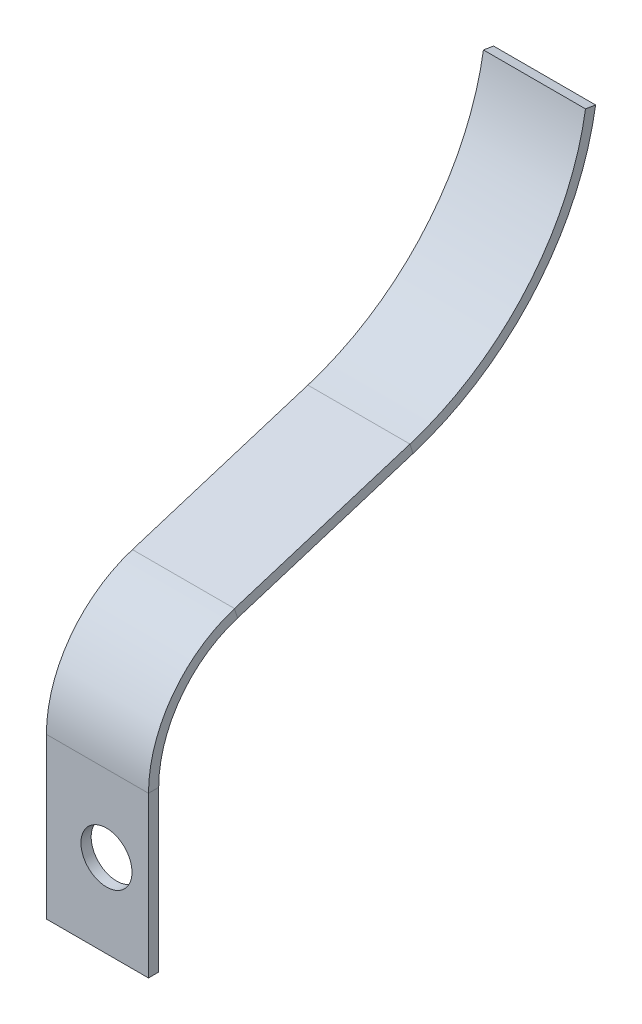
ISO-10303-21;
HEADER;
FILE_DESCRIPTION(('STEP AP214'),'2;1');
FILE_NAME('part.step','',(''),(''),'','','');
FILE_SCHEMA(('AUTOMOTIVE_DESIGN { 1 0 10303 214 1 1 1 1 }'));
ENDSEC;
DATA;
#1=APPLICATION_CONTEXT('core data for automotive mechanical design processes');
#2=APPLICATION_PROTOCOL_DEFINITION('international standard','automotive_design',2000,#1);
#3=PRODUCT_CONTEXT('',#1,'mechanical');
#4=PRODUCT('Part','Part','',(#3));
#5=PRODUCT_RELATED_PRODUCT_CATEGORY('part','',(#4));
#6=PRODUCT_DEFINITION_FORMATION('','',#4);
#7=PRODUCT_DEFINITION_CONTEXT('part definition',#1,'design');
#8=PRODUCT_DEFINITION('design','',#6,#7);
#9=PRODUCT_DEFINITION_SHAPE('','',#8);
#10=(LENGTH_UNIT() NAMED_UNIT(*) SI_UNIT(.MILLI.,.METRE.));
#11=(NAMED_UNIT(*) PLANE_ANGLE_UNIT() SI_UNIT($,.RADIAN.));
#12=(NAMED_UNIT(*) SI_UNIT($,.STERADIAN.) SOLID_ANGLE_UNIT());
#13=UNCERTAINTY_MEASURE_WITH_UNIT(LENGTH_MEASURE(1.E-05),#10,'distance_accuracy_value','');
#14=(GEOMETRIC_REPRESENTATION_CONTEXT(3) GLOBAL_UNCERTAINTY_ASSIGNED_CONTEXT((#13)) GLOBAL_UNIT_ASSIGNED_CONTEXT((#10,
#11,#12)) REPRESENTATION_CONTEXT('',''));
#15=CARTESIAN_POINT('',(0.,0.,0.));
#16=DIRECTION('',(0.,0.,1.));
#17=DIRECTION('',(1.,0.,0.));
#18=AXIS2_PLACEMENT_3D('',#15,#16,#17);
#19=CARTESIAN_POINT('',(10.,15.6695303644365,-1.00000000000001));
#20=DIRECTION('',(1.,0.,0.));
#21=DIRECTION('',(0.,0.,-1.));
#22=AXIS2_PLACEMENT_3D('',#19,#20,#21);
#23=PLANE('',#22);
#24=DIRECTION('',(0.,0.297840119412411,-0.954615767347471));
#25=VECTOR('',#24,1.);
#26=CARTESIAN_POINT('',(10.,27.1249195726061,-8.42591856705108));
#27=LINE('',#26,#25);
#28=CARTESIAN_POINT('',(10.,27.1249195726061,-8.42591856705108));
#29=VERTEX_POINT('',#28);
#30=CARTESIAN_POINT('',(10.,32.4860417220296,-25.6090023793056));
#31=VERTEX_POINT('',#30);
#32=EDGE_CURVE('E190',#29,#31,#27,.T.);
#33=ORIENTED_EDGE('',*,*,#32,.F.);
#34=DIRECTION('',(0.,-0.954615767347472,-0.29784011941241));
#35=VECTOR('',#34,1.);
#36=CARTESIAN_POINT('',(10.,27.1249195726061,-8.42591856705108));
#37=LINE('',#36,#35);
#38=CARTESIAN_POINT('',(10.,26.1703038052587,-8.72375868646348));
#39=VERTEX_POINT('',#38);
#40=EDGE_CURVE('E11',#29,#39,#37,.T.);
#41=ORIENTED_EDGE('',*,*,#40,.T.);
#42=DIRECTION('',(0.,0.297840119412411,-0.954615767347471));
#43=VECTOR('',#42,1.);
#44=CARTESIAN_POINT('',(10.,26.1703038052587,-8.72375868646348));
#45=LINE('',#44,#43);
#46=CARTESIAN_POINT('',(10.,31.5314259546821,-25.906842498718));
#47=VERTEX_POINT('',#46);
#48=EDGE_CURVE('E51',#39,#47,#45,.T.);
#49=ORIENTED_EDGE('',*,*,#48,.T.);
#50=DIRECTION('',(0.,0.954615767347474,0.297840119412401));
#51=VECTOR('',#50,1.);
#52=CARTESIAN_POINT('',(10.,31.5314259546821,-25.906842498718));
#53=LINE('',#52,#51);
#54=EDGE_CURVE('E215',#47,#31,#53,.T.);
#55=ORIENTED_EDGE('',*,*,#54,.T.);
#56=EDGE_LOOP('',(#33,#41,#49,#55));
#57=FACE_BOUND('',#56,.T.);
#58=ADVANCED_FACE('F37',(#57),#23,.T.);
#59=CARTESIAN_POINT('',(10.,31.5314259546821,-25.906842498718));
#60=DIRECTION('',(1.,0.,0.));
#61=DIRECTION('',(0.,0.,-1.));
#62=AXIS2_PLACEMENT_3D('',#59,#60,#61);
#63=PLANE('',#62);
#64=ORIENTED_EDGE('',*,*,#54,.F.);
#65=CARTESIAN_POINT('',(10.,56.3034253969733,-18.1779786727231));
#66=DIRECTION('',(1.,0.,0.));
#67=DIRECTION('',(0.,0.,-1.));
#68=AXIS2_PLACEMENT_3D('',#65,#66,#67);
#69=CIRCLE('',#68,25.9497069811905);
#70=CARTESIAN_POINT('',(10.,52.1576242284269,-43.7943723510012));
#71=VERTEX_POINT('',#70);
#72=EDGE_CURVE('E182',#47,#71,#69,.T.);
#73=ORIENTED_EDGE('',*,*,#72,.T.);
#74=DIRECTION('',(0.,-0.159762928018856,-0.987155411691008));
#75=VECTOR('',#74,1.);
#76=CARTESIAN_POINT('',(10.,52.3173871564458,-42.8072169393102));
#77=LINE('',#76,#75);
#78=CARTESIAN_POINT('',(10.,52.3173871564458,-42.8072169393102));
#79=VERTEX_POINT('',#78);
#80=EDGE_CURVE('E184',#79,#71,#77,.T.);
#81=ORIENTED_EDGE('',*,*,#80,.F.);
#82=CARTESIAN_POINT('',(10.,56.3034253969733,-18.1779786727231));
#83=DIRECTION('',(1.,0.,0.));
#84=DIRECTION('',(0.,0.,-1.));
#85=AXIS2_PLACEMENT_3D('',#82,#83,#84);
#86=CIRCLE('',#85,24.9497069811905);
#87=EDGE_CURVE('E187',#31,#79,#86,.T.);
#88=ORIENTED_EDGE('',*,*,#87,.F.);
#89=EDGE_LOOP('',(#64,#73,#81,#88));
#90=FACE_BOUND('',#89,.T.);
#91=ADVANCED_FACE('F252',(#90),#63,.T.);
#92=CARTESIAN_POINT('',(0.,32.4860417220296,-25.6090023793056));
#93=DIRECTION('',(-1.,0.,0.));
#94=DIRECTION('',(0.,0.,1.));
#95=AXIS2_PLACEMENT_3D('',#92,#93,#94);
#96=PLANE('',#95);
#97=DIRECTION('',(0.,-0.954615767347474,-0.297840119412401));
#98=VECTOR('',#97,1.);
#99=CARTESIAN_POINT('',(0.,32.4860417220296,-25.6090023793056));
#100=LINE('',#99,#98);
#101=CARTESIAN_POINT('',(0.,32.4860417220296,-25.6090023793056));
#102=VERTEX_POINT('',#101);
#103=CARTESIAN_POINT('',(0.,31.5314259546821,-25.906842498718));
#104=VERTEX_POINT('',#103);
#105=EDGE_CURVE('E213',#102,#104,#100,.T.);
#106=ORIENTED_EDGE('',*,*,#105,.F.);
#107=CARTESIAN_POINT('',(0.,56.3034253969733,-18.1779786727231));
#108=DIRECTION('',(1.,0.,0.));
#109=DIRECTION('',(0.,0.,-1.));
#110=AXIS2_PLACEMENT_3D('',#107,#108,#109);
#111=CIRCLE('',#110,24.9497069811905);
#112=CARTESIAN_POINT('',(0.,52.3173871564458,-42.8072169393102));
#113=VERTEX_POINT('',#112);
#114=EDGE_CURVE('E197',#102,#113,#111,.T.);
#115=ORIENTED_EDGE('',*,*,#114,.T.);
#116=DIRECTION('',(0.,-0.159762928018856,-0.987155411691008));
#117=VECTOR('',#116,1.);
#118=CARTESIAN_POINT('',(0.,52.3173871564458,-42.8072169393102));
#119=LINE('',#118,#117);
#120=CARTESIAN_POINT('',(0.,52.1576242284269,-43.7943723510012));
#121=VERTEX_POINT('',#120);
#122=EDGE_CURVE('E153',#113,#121,#119,.T.);
#123=ORIENTED_EDGE('',*,*,#122,.T.);
#124=CARTESIAN_POINT('',(0.,56.3034253969733,-18.1779786727231));
#125=DIRECTION('',(1.,0.,0.));
#126=DIRECTION('',(0.,0.,-1.));
#127=AXIS2_PLACEMENT_3D('',#124,#125,#126);
#128=CIRCLE('',#127,25.9497069811905);
#129=EDGE_CURVE('E150',#104,#121,#128,.T.);
#130=ORIENTED_EDGE('',*,*,#129,.F.);
#131=EDGE_LOOP('',(#106,#115,#123,#130));
#132=FACE_BOUND('',#131,.T.);
#133=ADVANCED_FACE('F257',(#132),#96,.T.);
#134=CARTESIAN_POINT('',(10.,56.3034253969733,-18.1779786727231));
#135=DIRECTION('',(-1.,0.,0.));
#136=DIRECTION('',(0.,0.,1.));
#137=AXIS2_PLACEMENT_3D('',#134,#135,#136);
#138=CYLINDRICAL_SURFACE('',#137,25.9497069811905);
#139=ORIENTED_EDGE('',*,*,#129,.T.);
#140=DIRECTION('',(-1.,0.,0.));
#141=VECTOR('',#140,1.);
#142=CARTESIAN_POINT('',(10.,52.1576242284269,-43.7943723510012));
#143=LINE('',#142,#141);
#144=EDGE_CURVE('E211',#71,#121,#143,.T.);
#145=ORIENTED_EDGE('',*,*,#144,.F.);
#146=ORIENTED_EDGE('',*,*,#72,.F.);
#147=DIRECTION('',(-1.,0.,0.));
#148=VECTOR('',#147,1.);
#149=CARTESIAN_POINT('',(10.,31.5314259546821,-25.906842498718));
#150=LINE('',#149,#148);
#151=EDGE_CURVE('E193',#47,#104,#150,.T.);
#152=ORIENTED_EDGE('',*,*,#151,.T.);
#153=EDGE_LOOP('',(#139,#145,#146,#152));
#154=FACE_BOUND('',#153,.T.);
#155=ADVANCED_FACE('F269',(#154),#138,.T.);
#156=CARTESIAN_POINT('',(10.,52.3173871564458,-42.8072169393102));
#157=DIRECTION('',(0.,0.987155411691008,-0.159762928018856));
#158=DIRECTION('',(0.,0.159762928018856,0.987155411691008));
#159=AXIS2_PLACEMENT_3D('',#156,#157,#158);
#160=PLANE('',#159);
#161=ORIENTED_EDGE('',*,*,#122,.F.);
#162=DIRECTION('',(-1.,0.,0.));
#163=VECTOR('',#162,1.);
#164=CARTESIAN_POINT('',(10.,52.3173871564458,-42.8072169393102));
#165=LINE('',#164,#163);
#166=EDGE_CURVE('E209',#79,#113,#165,.T.);
#167=ORIENTED_EDGE('',*,*,#166,.F.);
#168=ORIENTED_EDGE('',*,*,#80,.T.);
#169=ORIENTED_EDGE('',*,*,#144,.T.);
#170=EDGE_LOOP('',(#161,#167,#168,#169));
#171=FACE_BOUND('',#170,.T.);
#172=ADVANCED_FACE('F276',(#171),#160,.T.);
#173=CARTESIAN_POINT('',(10.,56.3034253969733,-18.1779786727231));
#174=DIRECTION('',(-1.,0.,0.));
#175=DIRECTION('',(0.,0.,1.));
#176=AXIS2_PLACEMENT_3D('',#173,#174,#175);
#177=CYLINDRICAL_SURFACE('',#176,24.9497069811905);
#178=ORIENTED_EDGE('',*,*,#114,.F.);
#179=DIRECTION('',(-1.,0.,0.));
#180=VECTOR('',#179,1.);
#181=CARTESIAN_POINT('',(10.,32.4860417220296,-25.6090023793056));
#182=LINE('',#181,#180);
#183=EDGE_CURVE('E206',#31,#102,#182,.T.);
#184=ORIENTED_EDGE('',*,*,#183,.F.);
#185=ORIENTED_EDGE('',*,*,#87,.T.);
#186=ORIENTED_EDGE('',*,*,#166,.T.);
#187=EDGE_LOOP('',(#178,#184,#185,#186));
#188=FACE_BOUND('',#187,.T.);
#189=ADVANCED_FACE('F274',(#188),#177,.F.);
#190=CARTESIAN_POINT('',(10.,27.1249195726061,-8.42591856705108));
#191=DIRECTION('',(0.,0.954615767347471,0.297840119412411));
#192=DIRECTION('',(0.,-0.297840119412411,0.954615767347471));
#193=AXIS2_PLACEMENT_3D('',#190,#191,#192);
#194=PLANE('',#193);
#195=DIRECTION('',(0.,0.297840119412411,-0.954615767347471));
#196=VECTOR('',#195,1.);
#197=CARTESIAN_POINT('',(0.,27.1249195726061,-8.42591856705108));
#198=LINE('',#197,#196);
#199=CARTESIAN_POINT('',(0.,27.1249195726062,-8.42591856705107));
#200=VERTEX_POINT('',#199);
#201=EDGE_CURVE('E200',#200,#102,#198,.T.);
#202=ORIENTED_EDGE('',*,*,#201,.F.);
#203=DIRECTION('',(-1.,0.,0.));
#204=VECTOR('',#203,1.);
#205=CARTESIAN_POINT('',(10.,27.1249195726061,-8.42591856705108));
#206=LINE('',#205,#204);
#207=EDGE_CURVE('E217',#29,#200,#206,.T.);
#208=ORIENTED_EDGE('',*,*,#207,.F.);
#209=ORIENTED_EDGE('',*,*,#32,.T.);
#210=ORIENTED_EDGE('',*,*,#183,.T.);
#211=EDGE_LOOP('',(#202,#208,#209,#210));
#212=FACE_BOUND('',#211,.T.);
#213=ADVANCED_FACE('F262',(#212),#194,.T.);
#214=CARTESIAN_POINT('',(10.,26.1703038052587,-8.72375868646348));
#215=DIRECTION('',(0.,0.954615767347471,0.297840119412411));
#216=DIRECTION('',(0.,-0.297840119412411,0.954615767347471));
#217=AXIS2_PLACEMENT_3D('',#214,#215,#216);
#218=PLANE('',#217);
#219=DIRECTION('',(0.,0.297840119412411,-0.954615767347471));
#220=VECTOR('',#219,1.);
#221=CARTESIAN_POINT('',(0.,26.1703038052587,-8.72375868646348));
#222=LINE('',#221,#220);
#223=CARTESIAN_POINT('',(0.,26.1703038052587,-8.72375868646348));
#224=VERTEX_POINT('',#223);
#225=EDGE_CURVE('E58',#224,#104,#222,.T.);
#226=ORIENTED_EDGE('',*,*,#225,.T.);
#227=ORIENTED_EDGE('',*,*,#151,.F.);
#228=ORIENTED_EDGE('',*,*,#48,.F.);
#229=DIRECTION('',(-1.,0.,0.));
#230=VECTOR('',#229,1.);
#231=CARTESIAN_POINT('',(10.,26.1703038052587,-8.72375868646348));
#232=LINE('',#231,#230);
#233=EDGE_CURVE('E44',#39,#224,#232,.T.);
#234=ORIENTED_EDGE('',*,*,#233,.T.);
#235=EDGE_LOOP('',(#226,#227,#228,#234));
#236=FACE_BOUND('',#235,.T.);
#237=ADVANCED_FACE('F222',(#236),#218,.F.);
#238=CARTESIAN_POINT('',(0.,56.3034253969733,-18.1779786727231));
#239=DIRECTION('',(1.,0.,0.));
#240=DIRECTION('',(0.,0.,-1.));
#241=AXIS2_PLACEMENT_3D('',#238,#239,#240);
#242=PLANE('',#241);
#243=ORIENTED_EDGE('',*,*,#201,.T.);
#244=ORIENTED_EDGE('',*,*,#105,.T.);
#245=ORIENTED_EDGE('',*,*,#225,.F.);
#246=DIRECTION('',(0.,0.954615767347472,0.29784011941241));
#247=VECTOR('',#246,1.);
#248=CARTESIAN_POINT('',(0.,26.1703038052587,-8.72375868646348));
#249=LINE('',#248,#247);
#250=EDGE_CURVE('E219',#224,#200,#249,.T.);
#251=ORIENTED_EDGE('',*,*,#250,.T.);
#252=EDGE_LOOP('',(#243,#244,#245,#251));
#253=FACE_BOUND('',#252,.T.);
#254=ADVANCED_FACE('F241',(#253),#242,.F.);
#255=CARTESIAN_POINT('',(10.,0.,-1.));
#256=DIRECTION('',(0.,-1.,0.));
#257=DIRECTION('',(0.,0.,-1.));
#258=AXIS2_PLACEMENT_3D('',#255,#256,#257);
#259=PLANE('',#258);
#260=DIRECTION('',(0.,0.,1.));
#261=VECTOR('',#260,1.);
#262=CARTESIAN_POINT('',(0.,0.,-1.));
#263=LINE('',#262,#261);
#264=CARTESIAN_POINT('',(0.,0.,-1.));
#265=VERTEX_POINT('',#264);
#266=CARTESIAN_POINT('',(0.,0.,0.));
#267=VERTEX_POINT('',#266);
#268=EDGE_CURVE('E165',#265,#267,#263,.T.);
#269=ORIENTED_EDGE('',*,*,#268,.F.);
#270=DIRECTION('',(-1.,0.,0.));
#271=VECTOR('',#270,1.);
#272=CARTESIAN_POINT('',(10.,0.,-1.));
#273=LINE('',#272,#271);
#274=CARTESIAN_POINT('',(10.,0.,-1.));
#275=VERTEX_POINT('',#274);
#276=EDGE_CURVE('E155',#275,#265,#273,.T.);
#277=ORIENTED_EDGE('',*,*,#276,.F.);
#278=DIRECTION('',(0.,0.,1.));
#279=VECTOR('',#278,1.);
#280=CARTESIAN_POINT('',(10.,0.,-1.));
#281=LINE('',#280,#279);
#282=CARTESIAN_POINT('',(10.,0.,0.));
#283=VERTEX_POINT('',#282);
#284=EDGE_CURVE('E178',#275,#283,#281,.T.);
#285=ORIENTED_EDGE('',*,*,#284,.T.);
#286=DIRECTION('',(-1.,0.,0.));
#287=VECTOR('',#286,1.);
#288=CARTESIAN_POINT('',(10.,0.,0.));
#289=LINE('',#288,#287);
#290=EDGE_CURVE('E139',#283,#267,#289,.T.);
#291=ORIENTED_EDGE('',*,*,#290,.T.);
#292=EDGE_LOOP('',(#269,#277,#285,#291));
#293=FACE_BOUND('',#292,.T.);
#294=ADVANCED_FACE('F238',(#293),#259,.T.);
#295=CARTESIAN_POINT('',(5.88464881690243,8.15936605661705,9.00000000002365));
#296=DIRECTION('',(0.,0.,-1.));
#297=DIRECTION('',(-1.,0.,0.));
#298=AXIS2_PLACEMENT_3D('',#295,#296,#297);
#299=CYLINDRICAL_SURFACE('',#298,2.5);
#300=CARTESIAN_POINT('',(5.88464881690243,8.15936605661705,0.));
#301=DIRECTION('',(0.,0.,1.));
#302=DIRECTION('',(1.,0.,0.));
#303=AXIS2_PLACEMENT_3D('',#300,#301,#302);
#304=CIRCLE('',#303,2.5);
#305=CARTESIAN_POINT('',(8.38464881690243,8.15936605661705,0.));
#306=VERTEX_POINT('',#305);
#307=EDGE_CURVE('E174',#306,#306,#304,.T.);
#308=ORIENTED_EDGE('',*,*,#307,.T.);
#309=EDGE_LOOP('',(#308));
#310=FACE_BOUND('',#309,.T.);
#311=CARTESIAN_POINT('',(5.88464881690243,8.15936605661705,-0.999999999976353));
#312=DIRECTION('',(0.,0.,-1.));
#313=DIRECTION('',(-1.,0.,0.));
#314=AXIS2_PLACEMENT_3D('',#311,#312,#313);
#315=CIRCLE('',#314,2.5);
#316=CARTESIAN_POINT('',(3.38464881690243,8.15936605661705,-0.999999999976353));
#317=VERTEX_POINT('',#316);
#318=EDGE_CURVE('E143',#317,#317,#315,.T.);
#319=ORIENTED_EDGE('',*,*,#318,.T.);
#320=EDGE_LOOP('',(#319));
#321=FACE_BOUND('',#320,.T.);
#322=ADVANCED_FACE('F240',(#310,#321),#299,.F.);
#323=CARTESIAN_POINT('',(10.,0.,0.));
#324=DIRECTION('',(0.,0.,1.));
#325=DIRECTION('',(1.,0.,0.));
#326=AXIS2_PLACEMENT_3D('',#323,#324,#325);
#327=PLANE('',#326);
#328=ORIENTED_EDGE('',*,*,#307,.F.);
#329=EDGE_LOOP('',(#328));
#330=FACE_BOUND('',#329,.T.);
#331=DIRECTION('',(0.,1.,0.));
#332=VECTOR('',#331,1.);
#333=CARTESIAN_POINT('',(0.,0.,0.));
#334=LINE('',#333,#332);
#335=CARTESIAN_POINT('',(0.,15.6695303644365,0.));
#336=VERTEX_POINT('',#335);
#337=EDGE_CURVE('E134',#267,#336,#334,.T.);
#338=ORIENTED_EDGE('',*,*,#337,.F.);
#339=ORIENTED_EDGE('',*,*,#290,.F.);
#340=DIRECTION('',(0.,1.,0.));
#341=VECTOR('',#340,1.);
#342=CARTESIAN_POINT('',(10.,0.,0.));
#343=LINE('',#342,#341);
#344=CARTESIAN_POINT('',(9.99999999999999,15.6695303644365,0.));
#345=VERTEX_POINT('',#344);
#346=EDGE_CURVE('E135',#283,#345,#343,.T.);
#347=ORIENTED_EDGE('',*,*,#346,.T.);
#348=DIRECTION('',(-1.,0.,0.));
#349=VECTOR('',#348,1.);
#350=CARTESIAN_POINT('',(10.,15.6695303644365,0.));
#351=LINE('',#350,#349);
#352=EDGE_CURVE('E127',#345,#336,#351,.T.);
#353=ORIENTED_EDGE('',*,*,#352,.T.);
#354=EDGE_LOOP('',(#338,#339,#347,#353));
#355=FACE_BOUND('',#354,.T.);
#356=ADVANCED_FACE('F138',(#330,#355),#327,.T.);
#357=CARTESIAN_POINT('',(0.,26.1703038052587,-8.72375868646348));
#358=DIRECTION('',(-1.,0.,0.));
#359=DIRECTION('',(0.,0.,1.));
#360=AXIS2_PLACEMENT_3D('',#357,#358,#359);
#361=PLANE('',#360);
#362=ORIENTED_EDGE('',*,*,#337,.T.);
#363=DIRECTION('',(0.,0.,-1.));
#364=VECTOR('',#363,1.);
#365=CARTESIAN_POINT('',(0.,15.6695303644365,0.));
#366=LINE('',#365,#364);
#367=CARTESIAN_POINT('',(0.,15.6695303644365,-0.999999999999997));
#368=VERTEX_POINT('',#367);
#369=EDGE_CURVE('E168',#336,#368,#366,.T.);
#370=ORIENTED_EDGE('',*,*,#369,.T.);
#371=DIRECTION('',(0.,1.,0.));
#372=VECTOR('',#371,1.);
#373=CARTESIAN_POINT('',(0.,0.,-1.));
#374=LINE('',#373,#372);
#375=EDGE_CURVE('E162',#265,#368,#374,.T.);
#376=ORIENTED_EDGE('',*,*,#375,.F.);
#377=ORIENTED_EDGE('',*,*,#268,.T.);
#378=EDGE_LOOP('',(#362,#370,#376,#377));
#379=FACE_BOUND('',#378,.T.);
#380=ADVANCED_FACE('F236',(#379),#361,.T.);
#381=CARTESIAN_POINT('',(10.,0.,-1.));
#382=DIRECTION('',(0.,0.,1.));
#383=DIRECTION('',(1.,0.,0.));
#384=AXIS2_PLACEMENT_3D('',#381,#382,#383);
#385=PLANE('',#384);
#386=ORIENTED_EDGE('',*,*,#318,.F.);
#387=EDGE_LOOP('',(#386));
#388=FACE_BOUND('',#387,.T.);
#389=ORIENTED_EDGE('',*,*,#375,.T.);
#390=DIRECTION('',(-1.,0.,0.));
#391=VECTOR('',#390,1.);
#392=CARTESIAN_POINT('',(10.,15.6695303644365,-0.999999999999997));
#393=LINE('',#392,#391);
#394=CARTESIAN_POINT('',(9.99999999999999,15.6695303644365,-1.));
#395=VERTEX_POINT('',#394);
#396=EDGE_CURVE('E180',#395,#368,#393,.T.);
#397=ORIENTED_EDGE('',*,*,#396,.F.);
#398=DIRECTION('',(0.,1.,0.));
#399=VECTOR('',#398,1.);
#400=CARTESIAN_POINT('',(10.,0.,-1.));
#401=LINE('',#400,#399);
#402=EDGE_CURVE('E148',#275,#395,#401,.T.);
#403=ORIENTED_EDGE('',*,*,#402,.F.);
#404=ORIENTED_EDGE('',*,*,#276,.T.);
#405=EDGE_LOOP('',(#389,#397,#403,#404));
#406=FACE_BOUND('',#405,.T.);
#407=ADVANCED_FACE('F232',(#388,#406),#385,.F.);
#408=CARTESIAN_POINT('',(10.,56.3034253969733,-18.1779786727231));
#409=DIRECTION('',(1.,0.,0.));
#410=DIRECTION('',(0.,0.,-1.));
#411=AXIS2_PLACEMENT_3D('',#408,#409,#410);
#412=PLANE('',#411);
#413=ORIENTED_EDGE('',*,*,#402,.T.);
#414=DIRECTION('',(0.,0.,1.));
#415=VECTOR('',#414,1.);
#416=CARTESIAN_POINT('',(10.,15.6695303644365,-0.999999999999997));
#417=LINE('',#416,#415);
#418=EDGE_CURVE('E118',#395,#345,#417,.T.);
#419=ORIENTED_EDGE('',*,*,#418,.T.);
#420=ORIENTED_EDGE('',*,*,#346,.F.);
#421=ORIENTED_EDGE('',*,*,#284,.F.);
#422=EDGE_LOOP('',(#413,#419,#420,#421));
#423=FACE_BOUND('',#422,.T.);
#424=ADVANCED_FACE('F146',(#423),#412,.T.);
#425=CARTESIAN_POINT('',(9.99999999999999,15.6695303644365,-12.));
#426=DIRECTION('',(1.,0.,0.));
#427=DIRECTION('',(0.,0.,-1.));
#428=AXIS2_PLACEMENT_3D('',#425,#426,#427);
#429=PLANE('',#428);
#430=ORIENTED_EDGE('',*,*,#418,.F.);
#431=CARTESIAN_POINT('',(9.99999999999999,15.6695303644365,-12.));
#432=DIRECTION('',(-1.,0.,0.));
#433=DIRECTION('',(0.,0.,1.));
#434=AXIS2_PLACEMENT_3D('',#431,#432,#433);
#435=CIRCLE('',#434,11.);
#436=EDGE_CURVE('E158',#395,#39,#435,.T.);
#437=ORIENTED_EDGE('',*,*,#436,.T.);
#438=ORIENTED_EDGE('',*,*,#40,.F.);
#439=CARTESIAN_POINT('',(9.99999999999999,15.6695303644365,-12.));
#440=DIRECTION('',(-1.,0.,0.));
#441=DIRECTION('',(0.,0.,1.));
#442=AXIS2_PLACEMENT_3D('',#439,#440,#441);
#443=CIRCLE('',#442,12.);
#444=EDGE_CURVE('E113',#345,#29,#443,.T.);
#445=ORIENTED_EDGE('',*,*,#444,.F.);
#446=EDGE_LOOP('',(#430,#437,#438,#445));
#447=FACE_BOUND('',#446,.T.);
#448=ADVANCED_FACE('F115',(#447),#429,.T.);
#449=CARTESIAN_POINT('',(0.,15.6695303644365,-12.));
#450=DIRECTION('',(-1.,0.,0.));
#451=DIRECTION('',(0.,0.,1.));
#452=AXIS2_PLACEMENT_3D('',#449,#450,#451);
#453=PLANE('',#452);
#454=ORIENTED_EDGE('',*,*,#250,.F.);
#455=CARTESIAN_POINT('',(0.,15.6695303644365,-12.));
#456=DIRECTION('',(-1.,0.,0.));
#457=DIRECTION('',(0.,0.,1.));
#458=AXIS2_PLACEMENT_3D('',#455,#456,#457);
#459=CIRCLE('',#458,11.);
#460=EDGE_CURVE('E123',#224,#368,#459,.F.);
#461=ORIENTED_EDGE('',*,*,#460,.T.);
#462=ORIENTED_EDGE('',*,*,#369,.F.);
#463=CARTESIAN_POINT('',(0.,15.6695303644365,-12.));
#464=DIRECTION('',(1.,0.,0.));
#465=DIRECTION('',(0.,0.,-1.));
#466=AXIS2_PLACEMENT_3D('',#463,#464,#465);
#467=CIRCLE('',#466,12.);
#468=EDGE_CURVE('E122',#200,#336,#467,.T.);
#469=ORIENTED_EDGE('',*,*,#468,.F.);
#470=EDGE_LOOP('',(#454,#461,#462,#469));
#471=FACE_BOUND('',#470,.T.);
#472=ADVANCED_FACE('F227',(#471),#453,.T.);
#473=CARTESIAN_POINT('',(105.503731274018,15.6695303644365,-12.));
#474=DIRECTION('',(-1.,0.,0.));
#475=DIRECTION('',(0.,0.,1.));
#476=AXIS2_PLACEMENT_3D('',#473,#474,#475);
#477=CYLINDRICAL_SURFACE('',#476,12.);
#478=ORIENTED_EDGE('',*,*,#468,.T.);
#479=ORIENTED_EDGE('',*,*,#352,.F.);
#480=ORIENTED_EDGE('',*,*,#444,.T.);
#481=ORIENTED_EDGE('',*,*,#207,.T.);
#482=EDGE_LOOP('',(#478,#479,#480,#481));
#483=FACE_BOUND('',#482,.T.);
#484=ADVANCED_FACE('F129',(#483),#477,.T.);
#485=CARTESIAN_POINT('',(105.503731274018,15.6695303644365,-12.));
#486=DIRECTION('',(-1.,0.,0.));
#487=DIRECTION('',(0.,0.,1.));
#488=AXIS2_PLACEMENT_3D('',#485,#486,#487);
#489=CYLINDRICAL_SURFACE('',#488,11.);
#490=ORIENTED_EDGE('',*,*,#460,.F.);
#491=ORIENTED_EDGE('',*,*,#233,.F.);
#492=ORIENTED_EDGE('',*,*,#436,.F.);
#493=ORIENTED_EDGE('',*,*,#396,.T.);
#494=EDGE_LOOP('',(#490,#491,#492,#493));
#495=FACE_BOUND('',#494,.T.);
#496=ADVANCED_FACE('F229',(#495),#489,.F.);
#497=CLOSED_SHELL('',(#58,#91,#133,#155,#172,#189,#213,#237,#254,#294,#322,#356,#380,#407,#424,
#448,#472,#484,#496));
#498=MANIFOLD_SOLID_BREP('B2',#497);
#499=ADVANCED_BREP_SHAPE_REPRESENTATION('',(#18,#498),#14);
#500=SHAPE_DEFINITION_REPRESENTATION(#9,#499);
ENDSEC;
END-ISO-10303-21;
